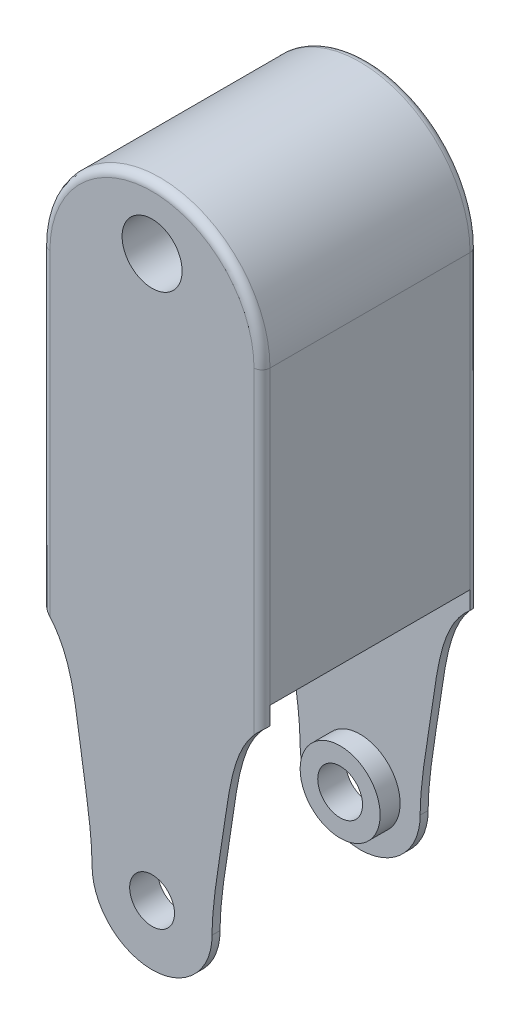
ISO-10303-21;
HEADER;
FILE_DESCRIPTION(('STEP AP214'),'2;1');
FILE_NAME('part.step','',(''),(''),'','','');
FILE_SCHEMA(('AUTOMOTIVE_DESIGN { 1 0 10303 214 1 1 1 1 }'));
ENDSEC;
DATA;
#1=APPLICATION_CONTEXT('core data for automotive mechanical design processes');
#2=APPLICATION_PROTOCOL_DEFINITION('international standard','automotive_design',2000,#1);
#3=PRODUCT_CONTEXT('',#1,'mechanical');
#4=PRODUCT('Part','Part','',(#3));
#5=PRODUCT_RELATED_PRODUCT_CATEGORY('part','',(#4));
#6=PRODUCT_DEFINITION_FORMATION('','',#4);
#7=PRODUCT_DEFINITION_CONTEXT('part definition',#1,'design');
#8=PRODUCT_DEFINITION('design','',#6,#7);
#9=PRODUCT_DEFINITION_SHAPE('','',#8);
#10=(LENGTH_UNIT() NAMED_UNIT(*) SI_UNIT(.MILLI.,.METRE.));
#11=(NAMED_UNIT(*) PLANE_ANGLE_UNIT() SI_UNIT($,.RADIAN.));
#12=(NAMED_UNIT(*) SI_UNIT($,.STERADIAN.) SOLID_ANGLE_UNIT());
#13=UNCERTAINTY_MEASURE_WITH_UNIT(LENGTH_MEASURE(1.E-05),#10,'distance_accuracy_value','');
#14=(GEOMETRIC_REPRESENTATION_CONTEXT(3) GLOBAL_UNCERTAINTY_ASSIGNED_CONTEXT((#13)) GLOBAL_UNIT_ASSIGNED_CONTEXT((#10,
#11,#12)) REPRESENTATION_CONTEXT('',''));
#15=CARTESIAN_POINT('',(0.,0.,0.));
#16=DIRECTION('',(0.,0.,1.));
#17=DIRECTION('',(1.,0.,0.));
#18=AXIS2_PLACEMENT_3D('',#15,#16,#17);
#19=CARTESIAN_POINT('',(36.9707204209095,142.990900166277,2.));
#20=DIRECTION('',(0.,0.,1.));
#21=DIRECTION('',(1.,0.,0.));
#22=AXIS2_PLACEMENT_3D('',#19,#20,#21);
#23=TOROIDAL_SURFACE('',#22,25.5,2.);
#24=CARTESIAN_POINT('',(62.4707204209095,142.990900166277,2.));
#25=DIRECTION('',(0.,-1.,0.));
#26=DIRECTION('',(0.,0.,-1.));
#27=AXIS2_PLACEMENT_3D('',#24,#25,#26);
#28=CIRCLE('',#27,2.);
#29=CARTESIAN_POINT('',(62.4707204209095,142.990900166277,0.));
#30=VERTEX_POINT('',#29);
#31=CARTESIAN_POINT('',(64.4707204209095,142.990900166277,2.));
#32=VERTEX_POINT('',#31);
#33=EDGE_CURVE('E12',#30,#32,#28,.T.);
#34=ORIENTED_EDGE('',*,*,#33,.F.);
#35=CARTESIAN_POINT('',(36.9707204209095,142.990900166277,0.));
#36=DIRECTION('',(0.,0.,1.));
#37=DIRECTION('',(1.,0.,0.));
#38=AXIS2_PLACEMENT_3D('',#35,#36,#37);
#39=CIRCLE('',#38,25.5);
#40=CARTESIAN_POINT('',(11.4707204209095,142.990900166277,0.));
#41=VERTEX_POINT('',#40);
#42=EDGE_CURVE('E408',#41,#30,#39,.F.);
#43=ORIENTED_EDGE('',*,*,#42,.F.);
#44=CARTESIAN_POINT('',(11.4707204209095,142.990900166277,2.));
#45=DIRECTION('',(0.,1.,0.));
#46=DIRECTION('',(0.,0.,1.));
#47=AXIS2_PLACEMENT_3D('',#44,#45,#46);
#48=CIRCLE('',#47,2.);
#49=CARTESIAN_POINT('',(9.47072042090954,142.990900166277,2.));
#50=VERTEX_POINT('',#49);
#51=EDGE_CURVE('E79',#41,#50,#48,.T.);
#52=ORIENTED_EDGE('',*,*,#51,.T.);
#53=CARTESIAN_POINT('',(36.9707204209095,142.990900166277,2.));
#54=DIRECTION('',(0.,0.,1.));
#55=DIRECTION('',(1.,0.,0.));
#56=AXIS2_PLACEMENT_3D('',#53,#54,#55);
#57=CIRCLE('',#56,27.5);
#58=EDGE_CURVE('E176',#32,#50,#57,.T.);
#59=ORIENTED_EDGE('',*,*,#58,.F.);
#60=EDGE_LOOP('',(#34,#43,#52,#59));
#61=FACE_BOUND('',#60,.T.);
#62=ADVANCED_FACE('F72',(#61),#23,.T.);
#63=CARTESIAN_POINT('',(11.4707204209095,0.,2.));
#64=DIRECTION('',(0.,1.,0.));
#65=DIRECTION('',(0.,0.,1.));
#66=AXIS2_PLACEMENT_3D('',#63,#64,#65);
#67=CYLINDRICAL_SURFACE('',#66,2.);
#68=ORIENTED_EDGE('',*,*,#51,.F.);
#69=DIRECTION('',(0.,1.,0.));
#70=VECTOR('',#69,1.);
#71=CARTESIAN_POINT('',(11.4707204209095,0.,0.));
#72=LINE('',#71,#70);
#73=CARTESIAN_POINT('',(11.4707204209095,63.6147126063138,0.));
#74=VERTEX_POINT('',#73);
#75=EDGE_CURVE('E405',#74,#41,#72,.T.);
#76=ORIENTED_EDGE('',*,*,#75,.F.);
#77=CARTESIAN_POINT('',(9.47072042090954,65.5541899717277,2.));
#78=CARTESIAN_POINT('',(9.47071047717841,65.5541962728773,1.95338896970983));
#79=CARTESIAN_POINT('',(9.47234956363022,65.5528357390161,1.90678388317699));
#80=CARTESIAN_POINT('',(9.47884995221513,65.5474296498482,1.81397756091869));
#81=CARTESIAN_POINT('',(9.48370970149895,65.5433853885052,1.76777614143583));
#82=CARTESIAN_POINT('',(9.49653739812568,65.5326923397141,1.67639637641352));
#83=CARTESIAN_POINT('',(9.50448666446431,65.5260592050907,1.63121357696197));
#84=CARTESIAN_POINT('',(9.52334899972217,65.5102819271053,1.54192820417429));
#85=CARTESIAN_POINT('',(9.53426228072028,65.5011376040642,1.49782570838148));
#86=CARTESIAN_POINT('',(9.57115895572199,65.4701295995274,1.36773595695999));
#87=CARTESIAN_POINT('',(9.60133263256857,65.44466331306,1.28373634298544));
#88=CARTESIAN_POINT('',(9.67112621389369,65.3852374495434,1.12297423054821));
#89=CARTESIAN_POINT('',(9.71075869742204,65.3512665594458,1.04622156095782));
#90=CARTESIAN_POINT('',(9.80040463071576,65.2736095630106,0.896297932378445));
#91=CARTESIAN_POINT('',(9.8509265128967,65.2294343624845,0.823686969129786));
#92=CARTESIAN_POINT('',(9.95833947017902,65.1343039487511,0.688446343844762));
#93=CARTESIAN_POINT('',(10.0152300755657,65.0833492355032,0.625815946532818));
#94=CARTESIAN_POINT('',(10.1656558013531,64.9467125405763,0.479129522209721));
#95=CARTESIAN_POINT('',(10.262336585965,64.8571797041258,0.401865395835025));
#96=CARTESIAN_POINT('',(10.4615744610854,64.6682143234012,0.269086343973096));
#97=CARTESIAN_POINT('',(10.5641591601723,64.5687333361212,0.21368505970429));
#98=CARTESIAN_POINT('',(10.735042629976,64.3988726836297,0.13876669548864));
#99=CARTESIAN_POINT('',(10.8028342712169,64.3304297569665,0.113472334319357));
#100=CARTESIAN_POINT('',(10.9385616366423,64.1911655832728,0.0707849911724412));
#101=CARTESIAN_POINT('',(11.0064974264853,64.1203427924269,0.053397248780108));
#102=CARTESIAN_POINT('',(11.1410565479503,63.9777560578748,0.0261762132517761));
#103=CARTESIAN_POINT('',(11.2076857307507,63.9060145095727,0.01625235390419));
#104=CARTESIAN_POINT('',(11.3399876216287,63.7612523831201,0.00317642649454057));
#105=CARTESIAN_POINT('',(11.4056616917116,63.688234039576,1.35288680119028E-05));
#106=CARTESIAN_POINT('',(11.4707204209095,63.6147126063138,0.));
#107=B_SPLINE_CURVE_WITH_KNOTS('',3,(#77,#78,#79,#80,#81,#82,#83,#84,#85,#86,#87,#88,#89,#90,
#91,#92,#93,#94,#95,#96,#97,#98,#99,#100,#101,#102,#103,#104,#105,#106),.UNSPECIFIED.,.F.,.F.,
(4,2,2,2,2,2,2,2,2,2,2,2,2,2,4),(0.,0.139774631087031,0.279481918526984,0.418357277827689,
0.557242576449319,0.834319971064426,1.11176791818241,1.40730934065786,1.70282898030532,
2.15855864592595,2.61662690151746,2.91509982317581,3.21377025067191,3.50875541888894,
3.80326773098129),.UNSPECIFIED.);
#108=CARTESIAN_POINT('',(9.47072042090954,65.5541899717277,2.));
#109=VERTEX_POINT('',#108);
#110=EDGE_CURVE('E272',#109,#74,#107,.T.);
#111=ORIENTED_EDGE('',*,*,#110,.F.);
#112=DIRECTION('',(0.,-1.,0.));
#113=VECTOR('',#112,1.);
#114=CARTESIAN_POINT('',(9.47072042090954,0.,2.));
#115=LINE('',#114,#113);
#116=CARTESIAN_POINT('',(9.47072042090955,70.,2.));
#117=VERTEX_POINT('',#116);
#118=EDGE_CURVE('E211',#117,#109,#115,.T.);
#119=ORIENTED_EDGE('',*,*,#118,.F.);
#120=DIRECTION('',(0.,1.,0.));
#121=VECTOR('',#120,1.);
#122=CARTESIAN_POINT('',(9.47072042090954,142.990900166277,2.));
#123=LINE('',#122,#121);
#124=EDGE_CURVE('E280',#50,#117,#123,.F.);
#125=ORIENTED_EDGE('',*,*,#124,.F.);
#126=EDGE_LOOP('',(#68,#76,#111,#119,#125));
#127=FACE_BOUND('',#126,.T.);
#128=ADVANCED_FACE('F282',(#127),#67,.T.);
#129=CARTESIAN_POINT('',(62.4707204209095,0.,2.));
#130=DIRECTION('',(0.,-1.,0.));
#131=DIRECTION('',(0.,0.,-1.));
#132=AXIS2_PLACEMENT_3D('',#129,#130,#131);
#133=CYLINDRICAL_SURFACE('',#132,2.);
#134=DIRECTION('',(0.,-1.,0.));
#135=VECTOR('',#134,1.);
#136=CARTESIAN_POINT('',(62.4707204209095,0.,0.));
#137=LINE('',#136,#135);
#138=CARTESIAN_POINT('',(62.4707204209095,63.54822419723,0.));
#139=VERTEX_POINT('',#138);
#140=EDGE_CURVE('E409',#30,#139,#137,.T.);
#141=ORIENTED_EDGE('',*,*,#140,.F.);
#142=ORIENTED_EDGE('',*,*,#33,.T.);
#143=DIRECTION('',(0.,-1.,0.));
#144=VECTOR('',#143,1.);
#145=CARTESIAN_POINT('',(64.4707204209095,142.990900166277,2.));
#146=LINE('',#145,#144);
#147=CARTESIAN_POINT('',(64.4707204209095,70.,2.));
#148=VERTEX_POINT('',#147);
#149=EDGE_CURVE('E168',#148,#32,#146,.F.);
#150=ORIENTED_EDGE('',*,*,#149,.F.);
#151=DIRECTION('',(0.,1.,0.));
#152=VECTOR('',#151,1.);
#153=CARTESIAN_POINT('',(64.4707204209095,0.,2.));
#154=LINE('',#153,#152);
#155=CARTESIAN_POINT('',(64.4707204209095,65.5053070407885,2.));
#156=VERTEX_POINT('',#155);
#157=EDGE_CURVE('E172',#156,#148,#154,.T.);
#158=ORIENTED_EDGE('',*,*,#157,.F.);
#159=CARTESIAN_POINT('',(62.4707204209095,63.54822419723,0.));
#160=CARTESIAN_POINT('',(62.5441057424861,63.6319652745113,2.20051502430552E-05));
#161=CARTESIAN_POINT('',(62.6182982463745,63.715072557465,0.00404263495905445));
#162=CARTESIAN_POINT('',(62.7679253463713,63.879669879174,0.0207632202095305));
#163=CARTESIAN_POINT('',(62.8433627455207,63.9611549694089,0.03348648035841));
#164=CARTESIAN_POINT('',(62.9955855335355,64.1226341907436,0.068503640627136));
#165=CARTESIAN_POINT('',(63.0723764022221,64.202600011731,0.0909069861975637));
#166=CARTESIAN_POINT('',(63.2254614059481,64.3591893370318,0.146090585630653));
#167=CARTESIAN_POINT('',(63.301756033511,64.4358168081339,0.178858119193551));
#168=CARTESIAN_POINT('',(63.4703643694932,64.602256842793,0.264598493103674));
#169=CARTESIAN_POINT('',(63.5622849691218,64.6910004267453,0.320496071517096));
#170=CARTESIAN_POINT('',(63.7404176776921,64.8596110712055,0.450813321240541));
#171=CARTESIAN_POINT('',(63.8266510338658,64.9395120274531,0.525158452066944));
#172=CARTESIAN_POINT('',(63.9739481034515,65.0736549845569,0.677394217181054));
#173=CARTESIAN_POINT('',(64.0366757414499,65.129884479653,0.751905375666595));
#174=CARTESIAN_POINT('',(64.1529458354946,65.2328685443936,0.913716347476554));
#175=CARTESIAN_POINT('',(64.2064927117992,65.2796276757082,1.00100996868375));
#176=CARTESIAN_POINT('',(64.2933772217627,65.3548056422789,1.17200697671687));
#177=CARTESIAN_POINT('',(64.3285847814029,65.384969926145,1.25398959471054));
#178=CARTESIAN_POINT('',(64.3882490027613,65.4358105821797,1.42449301192564));
#179=CARTESIAN_POINT('',(64.4127235974864,65.4565027831865,1.51300261428233));
#180=CARTESIAN_POINT('',(64.4440986708557,65.4829575480818,1.66816071101614));
#181=CARTESIAN_POINT('',(64.4540290312737,65.491302304072,1.73377589893191));
#182=CARTESIAN_POINT('',(64.4673633343918,65.5024927882459,1.86624159522534));
#183=CARTESIAN_POINT('',(64.4707557817086,65.5053288307206,1.93309407116868));
#184=CARTESIAN_POINT('',(64.4707204209095,65.5053070405309,2.00000000004391));
#185=B_SPLINE_CURVE_WITH_KNOTS('',3,(#159,#160,#161,#162,#163,#164,#165,#166,#167,#168,#169,
#170,#171,#172,#173,#174,#175,#176,#177,#178,#179,#180,#181,#182,#183,#184),.UNSPECIFIED.,.F.,
.F.,(4,2,2,2,2,2,2,2,2,2,2,2,4),(0.,0.334044934144329,0.668987925001582,1.00782124041015,
1.34624029806866,1.76322586095667,2.17855320385325,2.51468182995748,2.85064816306123,
3.13203237769417,3.41294463778561,3.61307040868564,3.81354773382866),.UNSPECIFIED.);
#186=EDGE_CURVE('E175',#139,#156,#185,.T.);
#187=ORIENTED_EDGE('',*,*,#186,.F.);
#188=EDGE_LOOP('',(#141,#142,#150,#158,#187));
#189=FACE_BOUND('',#188,.T.);
#190=ADVANCED_FACE('F170',(#189),#133,.T.);
#191=CARTESIAN_POINT('',(36.9707204209095,142.990900166277,52.));
#192=DIRECTION('',(0.,0.,1.));
#193=DIRECTION('',(1.,0.,0.));
#194=AXIS2_PLACEMENT_3D('',#191,#192,#193);
#195=TOROIDAL_SURFACE('',#194,25.5,2.);
#196=CARTESIAN_POINT('',(11.4707204209095,142.990900166277,52.));
#197=DIRECTION('',(0.,-1.,0.));
#198=DIRECTION('',(0.,0.,-1.));
#199=AXIS2_PLACEMENT_3D('',#196,#197,#198);
#200=CIRCLE('',#199,2.);
#201=CARTESIAN_POINT('',(11.4707204209095,142.990900166277,54.));
#202=VERTEX_POINT('',#201);
#203=CARTESIAN_POINT('',(9.47072042090954,142.990900166277,52.));
#204=VERTEX_POINT('',#203);
#205=EDGE_CURVE('E414',#202,#204,#200,.T.);
#206=ORIENTED_EDGE('',*,*,#205,.F.);
#207=CARTESIAN_POINT('',(36.9707204209095,142.990900166277,54.));
#208=DIRECTION('',(0.,0.,1.));
#209=DIRECTION('',(1.,0.,0.));
#210=AXIS2_PLACEMENT_3D('',#207,#208,#209);
#211=CIRCLE('',#210,25.5);
#212=CARTESIAN_POINT('',(62.4707204209095,142.990900166277,54.));
#213=VERTEX_POINT('',#212);
#214=EDGE_CURVE('E495',#213,#202,#211,.T.);
#215=ORIENTED_EDGE('',*,*,#214,.F.);
#216=CARTESIAN_POINT('',(62.4707204209095,142.990900166277,52.));
#217=DIRECTION('',(0.,1.,0.));
#218=DIRECTION('',(0.,0.,1.));
#219=AXIS2_PLACEMENT_3D('',#216,#217,#218);
#220=CIRCLE('',#219,2.);
#221=CARTESIAN_POINT('',(64.4707204209095,142.990900166277,52.));
#222=VERTEX_POINT('',#221);
#223=EDGE_CURVE('E416',#213,#222,#220,.T.);
#224=ORIENTED_EDGE('',*,*,#223,.T.);
#225=CARTESIAN_POINT('',(36.9707204209095,142.990900166277,52.));
#226=DIRECTION('',(0.,0.,1.));
#227=DIRECTION('',(1.,0.,0.));
#228=AXIS2_PLACEMENT_3D('',#225,#226,#227);
#229=CIRCLE('',#228,27.5);
#230=EDGE_CURVE('E426',#204,#222,#229,.F.);
#231=ORIENTED_EDGE('',*,*,#230,.F.);
#232=EDGE_LOOP('',(#206,#215,#224,#231));
#233=FACE_BOUND('',#232,.T.);
#234=ADVANCED_FACE('F287',(#233),#195,.T.);
#235=CARTESIAN_POINT('',(62.4707204209095,0.,52.));
#236=DIRECTION('',(0.,-1.,0.));
#237=DIRECTION('',(0.,0.,-1.));
#238=AXIS2_PLACEMENT_3D('',#235,#236,#237);
#239=CYLINDRICAL_SURFACE('',#238,2.);
#240=ORIENTED_EDGE('',*,*,#223,.F.);
#241=DIRECTION('',(0.,1.,0.));
#242=VECTOR('',#241,1.);
#243=CARTESIAN_POINT('',(62.4707204209095,0.,54.));
#244=LINE('',#243,#242);
#245=CARTESIAN_POINT('',(62.4707204209095,63.54822419723,54.));
#246=VERTEX_POINT('',#245);
#247=EDGE_CURVE('E482',#246,#213,#244,.T.);
#248=ORIENTED_EDGE('',*,*,#247,.F.);
#249=CARTESIAN_POINT('',(64.4707204209095,65.5053070407885,52.));
#250=CARTESIAN_POINT('',(64.4707303988852,65.5053134326946,52.0465062267122));
#251=CARTESIAN_POINT('',(64.4690985997476,65.5039474120796,52.0930064605758));
#252=CARTESIAN_POINT('',(64.4626275572252,65.4985199186537,52.1856027899285));
#253=CARTESIAN_POINT('',(64.4577898803378,65.4944597622848,52.2316990716612));
#254=CARTESIAN_POINT('',(64.4450215788353,65.4837256676826,52.3228664211467));
#255=CARTESIAN_POINT('',(64.4371097365506,65.4770676009666,52.3679419882689));
#256=CARTESIAN_POINT('',(64.4183377808386,65.4612324251754,52.4570136130179));
#257=CARTESIAN_POINT('',(64.4074774526058,65.452055132567,52.5010095917388));
#258=CARTESIAN_POINT('',(64.3707640344463,65.420939088865,52.6307796298619));
#259=CARTESIAN_POINT('',(64.3407447976305,65.395388148577,52.7145681497441));
#260=CARTESIAN_POINT('',(64.2713239119989,65.3357793056089,52.8749258376739));
#261=CARTESIAN_POINT('',(64.2319095891647,65.3017099084228,52.9514850568791));
#262=CARTESIAN_POINT('',(64.1427556438496,65.2238287273929,53.1010744152663));
#263=CARTESIAN_POINT('',(64.0925078139832,65.1795239630006,53.1735423146327));
#264=CARTESIAN_POINT('',(63.9856970259488,65.0841351833331,53.3085357699718));
#265=CARTESIAN_POINT('',(63.9291345974232,65.033051736558,53.3710621587324));
#266=CARTESIAN_POINT('',(63.7792097781466,64.8957391523267,53.5179313883503));
#267=CARTESIAN_POINT('',(63.6826856253408,64.8056062074703,53.5954180812204));
#268=CARTESIAN_POINT('',(63.4837904644989,64.6153858643246,53.7286184514229));
#269=CARTESIAN_POINT('',(63.3813916683527,64.5152491503573,53.7842168395878));
#270=CARTESIAN_POINT('',(63.2103097424011,64.3437526256795,53.8597027003456));
#271=CARTESIAN_POINT('',(63.1421193878688,64.2743143928675,53.885297244533));
#272=CARTESIAN_POINT('',(63.0056079389765,64.1330174367349,53.9284768596655));
#273=CARTESIAN_POINT('',(62.9372867871967,64.0611570966476,53.9460564621611));
#274=CARTESIAN_POINT('',(62.8019996990418,63.9164962732735,53.9735663455655));
#275=CARTESIAN_POINT('',(62.7350275201776,63.8437189428401,53.9835899508322));
#276=CARTESIAN_POINT('',(62.6020681887186,63.6968706091834,53.9967941136659));
#277=CARTESIAN_POINT('',(62.5360795970668,63.6228019308231,53.9999859001853));
#278=CARTESIAN_POINT('',(62.4707204209095,63.54822419723,54.));
#279=B_SPLINE_CURVE_WITH_KNOTS('',3,(#249,#250,#251,#252,#253,#254,#255,#256,#257,#258,#259,
#260,#261,#262,#263,#264,#265,#266,#267,#268,#269,#270,#271,#272,#273,#274,#275,#276,#277,#278),
.UNSPECIFIED.,.F.,.F.,(4,2,2,2,2,2,2,2,2,2,2,2,2,2,4),(0.,0.139460130116107,0.278852165615816,
0.417405615510833,0.555969162124937,0.832396205338673,1.10919828171202,1.4041844650486,
1.69914592472802,2.15596477285992,2.61515855795383,2.91672160003086,3.21849008632844,
3.51646743413719,3.8139546414552),.UNSPECIFIED.);
#280=CARTESIAN_POINT('',(64.4707204209095,65.5053070407885,52.));
#281=VERTEX_POINT('',#280);
#282=EDGE_CURVE('E429',#281,#246,#279,.T.);
#283=ORIENTED_EDGE('',*,*,#282,.F.);
#284=DIRECTION('',(0.,-1.,0.));
#285=VECTOR('',#284,1.);
#286=CARTESIAN_POINT('',(64.4707204209095,70.,52.));
#287=LINE('',#286,#285);
#288=CARTESIAN_POINT('',(64.4707204209095,70.,52.));
#289=VERTEX_POINT('',#288);
#290=EDGE_CURVE('E200',#289,#281,#287,.T.);
#291=ORIENTED_EDGE('',*,*,#290,.F.);
#292=DIRECTION('',(0.,1.,0.));
#293=VECTOR('',#292,1.);
#294=CARTESIAN_POINT('',(64.4707204209095,0.,52.));
#295=LINE('',#294,#293);
#296=EDGE_CURVE('E182',#222,#289,#295,.F.);
#297=ORIENTED_EDGE('',*,*,#296,.F.);
#298=EDGE_LOOP('',(#240,#248,#283,#291,#297));
#299=FACE_BOUND('',#298,.T.);
#300=ADVANCED_FACE('F438',(#299),#239,.T.);
#301=CARTESIAN_POINT('',(11.4707204209095,0.,52.));
#302=DIRECTION('',(0.,1.,0.));
#303=DIRECTION('',(0.,0.,1.));
#304=AXIS2_PLACEMENT_3D('',#301,#302,#303);
#305=CYLINDRICAL_SURFACE('',#304,2.);
#306=DIRECTION('',(0.,-1.,0.));
#307=VECTOR('',#306,1.);
#308=CARTESIAN_POINT('',(11.4707204209095,0.,54.));
#309=LINE('',#308,#307);
#310=CARTESIAN_POINT('',(11.4707204209095,63.6147126063138,54.));
#311=VERTEX_POINT('',#310);
#312=EDGE_CURVE('E374',#202,#311,#309,.T.);
#313=ORIENTED_EDGE('',*,*,#312,.F.);
#314=ORIENTED_EDGE('',*,*,#205,.T.);
#315=DIRECTION('',(0.,-1.,0.));
#316=VECTOR('',#315,1.);
#317=CARTESIAN_POINT('',(9.47072042090954,0.,52.));
#318=LINE('',#317,#316);
#319=CARTESIAN_POINT('',(9.47072042090955,70.,52.));
#320=VERTEX_POINT('',#319);
#321=EDGE_CURVE('E422',#320,#204,#318,.F.);
#322=ORIENTED_EDGE('',*,*,#321,.F.);
#323=DIRECTION('',(0.,1.,0.));
#324=VECTOR('',#323,1.);
#325=CARTESIAN_POINT('',(9.47072042090954,70.,52.));
#326=LINE('',#325,#324);
#327=CARTESIAN_POINT('',(9.47072042090954,65.5541899717277,52.));
#328=VERTEX_POINT('',#327);
#329=EDGE_CURVE('E199',#328,#320,#326,.T.);
#330=ORIENTED_EDGE('',*,*,#329,.F.);
#331=CARTESIAN_POINT('',(11.4707204209095,63.6147126063138,54.));
#332=CARTESIAN_POINT('',(11.3976453688247,63.6972981294634,53.999978881365));
#333=CARTESIAN_POINT('',(11.3237806120137,63.7792566128206,53.9959915730982));
#334=CARTESIAN_POINT('',(11.1748453381045,63.9415718733119,53.9794222600896));
#335=CARTESIAN_POINT('',(11.0997721654772,64.0219238827553,53.9668177282142));
#336=CARTESIAN_POINT('',(10.9483209964411,64.1811456743484,53.9321475853824));
#337=CARTESIAN_POINT('',(10.8719379026328,64.2599879462198,53.9099752853356));
#338=CARTESIAN_POINT('',(10.7196811100264,64.4143874535374,53.85539070402));
#339=CARTESIAN_POINT('',(10.6438069124737,64.4899484935347,53.8229906630104));
#340=CARTESIAN_POINT('',(10.4751898463058,64.6550158114735,53.7377849556318));
#341=CARTESIAN_POINT('',(10.3828612676624,64.743411343639,53.6819263432348));
#342=CARTESIAN_POINT('',(10.203971219409,64.911327370077,53.5516196739219));
#343=CARTESIAN_POINT('',(10.1173883521877,64.9908816358474,53.477246136333));
#344=CARTESIAN_POINT('',(9.96951514592859,65.1244230397715,53.3249165329429));
#345=CARTESIAN_POINT('',(9.90654910430813,65.1803934186846,53.250343673367));
#346=CARTESIAN_POINT('',(9.78985550485987,65.2828865057833,53.0884038281129));
#347=CARTESIAN_POINT('',(9.73612358187842,65.3294136798551,53.0010429239686));
#348=CARTESIAN_POINT('',(9.64885636112767,65.404289343073,52.8297669892486));
#349=CARTESIAN_POINT('',(9.61346315117936,65.4343575116274,52.7475535344984));
#350=CARTESIAN_POINT('',(9.55350029384863,65.485022262643,52.5765765461332));
#351=CARTESIAN_POINT('',(9.52891274403235,65.5056345138369,52.4878241331327));
#352=CARTESIAN_POINT('',(9.49741959655068,65.5319646843878,52.3323211150152));
#353=CARTESIAN_POINT('',(9.48745969900727,65.5402636141025,52.2666061601864));
#354=CARTESIAN_POINT('',(9.47408695546579,65.5513916270586,52.1339464452592));
#355=CARTESIAN_POINT('',(9.47068534366946,65.5542113245586,52.0669997728819));
#356=CARTESIAN_POINT('',(9.47072042090954,65.5541899778969,52.0000000010445));
#357=B_SPLINE_CURVE_WITH_KNOTS('',3,(#331,#332,#333,#334,#335,#336,#337,#338,#339,#340,#341,
#342,#343,#344,#345,#346,#347,#348,#349,#350,#351,#352,#353,#354,#355,#356),.UNSPECIFIED.,.F.,
.F.,(4,2,2,2,2,2,2,2,2,2,2,2,4),(0.,0.330826168727681,0.662520506508853,0.998013186374074,
1.33310587102797,1.75017674388598,2.16559537675458,2.50185463330718,2.83795449347336,
3.12005297358858,3.40168230465122,3.60209910785155,3.80285891674193),.UNSPECIFIED.);
#358=EDGE_CURVE('E263',#311,#328,#357,.T.);
#359=ORIENTED_EDGE('',*,*,#358,.F.);
#360=EDGE_LOOP('',(#313,#314,#322,#330,#359));
#361=FACE_BOUND('',#360,.T.);
#362=ADVANCED_FACE('F442',(#361),#305,.T.);
#363=CARTESIAN_POINT('',(0.,0.,2.));
#364=DIRECTION('',(0.,0.,-1.));
#365=DIRECTION('',(-1.,0.,0.));
#366=AXIS2_PLACEMENT_3D('',#363,#364,#365);
#367=PLANE('',#366);
#368=DIRECTION('',(-1.,0.,0.));
#369=VECTOR('',#368,1.);
#370=CARTESIAN_POINT('',(0.,70.,2.));
#371=LINE('',#370,#369);
#372=EDGE_CURVE('E196',#148,#117,#371,.T.);
#373=ORIENTED_EDGE('',*,*,#372,.T.);
#374=ORIENTED_EDGE('',*,*,#118,.T.);
#375=CARTESIAN_POINT('',(22.,15.,2.));
#376=CARTESIAN_POINT('',(22.,22.3179609326105,2.));
#377=CARTESIAN_POINT('',(17.7777196426996,44.524463783592,2.));
#378=CARTESIAN_POINT('',(15.9035134383819,66.3006355740785,2.));
#379=CARTESIAN_POINT('',(0.,70.,2.));
#380=B_SPLINE_CURVE_WITH_KNOTS('',3,(#375,#376,#377,#378,#379),.UNSPECIFIED.,.F.,.F.,(4,1,4),
(0.,0.399675275534026,1.),.UNSPECIFIED.);
#381=CARTESIAN_POINT('',(22.,15.,2.));
#382=VERTEX_POINT('',#381);
#383=EDGE_CURVE('E371',#382,#109,#380,.T.);
#384=ORIENTED_EDGE('',*,*,#383,.F.);
#385=CARTESIAN_POINT('',(37.,15.,2.));
#386=DIRECTION('',(0.,0.,-1.));
#387=DIRECTION('',(-1.,0.,0.));
#388=AXIS2_PLACEMENT_3D('',#385,#386,#387);
#389=CIRCLE('',#388,15.);
#390=CARTESIAN_POINT('',(52.,15.,2.));
#391=VERTEX_POINT('',#390);
#392=EDGE_CURVE('E350',#391,#382,#389,.T.);
#393=ORIENTED_EDGE('',*,*,#392,.F.);
#394=CARTESIAN_POINT('',(74.,70.,2.));
#395=CARTESIAN_POINT('',(58.0964865616181,66.3006355740785,2.));
#396=CARTESIAN_POINT('',(56.2222803573004,44.524463783592,2.));
#397=CARTESIAN_POINT('',(52.,22.3179609326106,2.));
#398=CARTESIAN_POINT('',(52.,15.,2.));
#399=B_SPLINE_CURVE_WITH_KNOTS('',3,(#394,#395,#396,#397,#398),.UNSPECIFIED.,.F.,.F.,(4,1,4),
(0.,0.600324724465974,1.),.UNSPECIFIED.);
#400=EDGE_CURVE('E198',#156,#391,#399,.T.);
#401=ORIENTED_EDGE('',*,*,#400,.F.);
#402=ORIENTED_EDGE('',*,*,#157,.T.);
#403=EDGE_LOOP('',(#373,#374,#384,#393,#401,#402));
#404=FACE_BOUND('',#403,.T.);
#405=CARTESIAN_POINT('',(37.,15.,2.));
#406=DIRECTION('',(0.,0.,-1.));
#407=DIRECTION('',(-1.,0.,0.));
#408=AXIS2_PLACEMENT_3D('',#405,#406,#407);
#409=CIRCLE('',#408,10.);
#410=CARTESIAN_POINT('',(27.,15.,2.));
#411=VERTEX_POINT('',#410);
#412=EDGE_CURVE('E189',#411,#411,#409,.F.);
#413=ORIENTED_EDGE('',*,*,#412,.F.);
#414=EDGE_LOOP('',(#413));
#415=FACE_BOUND('',#414,.T.);
#416=ADVANCED_FACE('F193',(#404,#415),#367,.F.);
#417=CARTESIAN_POINT('',(0.,70.,52.));
#418=DIRECTION('',(0.,0.,1.));
#419=DIRECTION('',(0.,-1.,0.));
#420=AXIS2_PLACEMENT_3D('',#417,#418,#419);
#421=PLANE('',#420);
#422=CARTESIAN_POINT('',(22.,15.,52.));
#423=CARTESIAN_POINT('',(22.,22.3179609326105,52.));
#424=CARTESIAN_POINT('',(17.7777196426996,44.524463783592,52.));
#425=CARTESIAN_POINT('',(15.9035134383819,66.3006355740785,52.));
#426=CARTESIAN_POINT('',(0.,70.,52.));
#427=B_SPLINE_CURVE_WITH_KNOTS('',3,(#422,#423,#424,#425,#426),.UNSPECIFIED.,.F.,.F.,(4,1,4),
(0.,0.399675275534026,1.),.UNSPECIFIED.);
#428=CARTESIAN_POINT('',(22.,15.,52.));
#429=VERTEX_POINT('',#428);
#430=EDGE_CURVE('E368',#328,#429,#427,.F.);
#431=ORIENTED_EDGE('',*,*,#430,.F.);
#432=ORIENTED_EDGE('',*,*,#329,.T.);
#433=DIRECTION('',(1.,0.,0.));
#434=VECTOR('',#433,1.);
#435=CARTESIAN_POINT('',(0.,70.,52.));
#436=LINE('',#435,#434);
#437=EDGE_CURVE('E206',#320,#289,#436,.T.);
#438=ORIENTED_EDGE('',*,*,#437,.T.);
#439=ORIENTED_EDGE('',*,*,#290,.T.);
#440=CARTESIAN_POINT('',(74.,70.,52.));
#441=CARTESIAN_POINT('',(58.0964865616181,66.3006355740785,52.));
#442=CARTESIAN_POINT('',(56.2222803573004,44.524463783592,52.));
#443=CARTESIAN_POINT('',(52.,22.3179609326106,52.));
#444=CARTESIAN_POINT('',(52.,15.,52.));
#445=B_SPLINE_CURVE_WITH_KNOTS('',3,(#440,#441,#442,#443,#444),.UNSPECIFIED.,.F.,.F.,(4,1,4),
(0.,0.600324724465974,1.),.UNSPECIFIED.);
#446=CARTESIAN_POINT('',(52.,15.,52.));
#447=VERTEX_POINT('',#446);
#448=EDGE_CURVE('E343',#447,#281,#445,.F.);
#449=ORIENTED_EDGE('',*,*,#448,.F.);
#450=CARTESIAN_POINT('',(37.,15.,52.));
#451=DIRECTION('',(0.,0.,1.));
#452=DIRECTION('',(1.,0.,0.));
#453=AXIS2_PLACEMENT_3D('',#450,#451,#452);
#454=CIRCLE('',#453,15.);
#455=EDGE_CURVE('E331',#429,#447,#454,.T.);
#456=ORIENTED_EDGE('',*,*,#455,.F.);
#457=EDGE_LOOP('',(#431,#432,#438,#439,#449,#456));
#458=FACE_BOUND('',#457,.T.);
#459=CARTESIAN_POINT('',(37.,15.,52.));
#460=DIRECTION('',(0.,0.,1.));
#461=DIRECTION('',(0.,-1.,0.));
#462=AXIS2_PLACEMENT_3D('',#459,#460,#461);
#463=CIRCLE('',#462,10.);
#464=CARTESIAN_POINT('',(37.,5.,52.));
#465=VERTEX_POINT('',#464);
#466=EDGE_CURVE('E354',#465,#465,#463,.F.);
#467=ORIENTED_EDGE('',*,*,#466,.F.);
#468=EDGE_LOOP('',(#467));
#469=FACE_BOUND('',#468,.T.);
#470=ADVANCED_FACE('F302',(#458,#469),#421,.F.);
#471=CARTESIAN_POINT('',(0.,0.,54.));
#472=DIRECTION('',(0.,0.,1.));
#473=DIRECTION('',(1.,0.,0.));
#474=AXIS2_PLACEMENT_3D('',#471,#472,#473);
#475=PLANE('',#474);
#476=CARTESIAN_POINT('',(74.,70.,54.));
#477=CARTESIAN_POINT('',(58.0964865616181,66.3006355740785,54.));
#478=CARTESIAN_POINT('',(56.2222803573004,44.524463783592,54.));
#479=CARTESIAN_POINT('',(52.,22.3179609326106,54.));
#480=CARTESIAN_POINT('',(52.,15.,54.));
#481=B_SPLINE_CURVE_WITH_KNOTS('',3,(#476,#477,#478,#479,#480),.UNSPECIFIED.,.F.,.F.,(4,1,4),
(0.,0.600324724465974,1.),.UNSPECIFIED.);
#482=CARTESIAN_POINT('',(52.,15.,54.));
#483=VERTEX_POINT('',#482);
#484=EDGE_CURVE('E337',#483,#246,#481,.F.);
#485=ORIENTED_EDGE('',*,*,#484,.T.);
#486=ORIENTED_EDGE('',*,*,#247,.T.);
#487=ORIENTED_EDGE('',*,*,#214,.T.);
#488=ORIENTED_EDGE('',*,*,#312,.T.);
#489=CARTESIAN_POINT('',(22.,15.,54.));
#490=CARTESIAN_POINT('',(22.,22.3179609326105,54.));
#491=CARTESIAN_POINT('',(17.7777196426996,44.524463783592,54.));
#492=CARTESIAN_POINT('',(15.9035134383819,66.3006355740785,54.));
#493=CARTESIAN_POINT('',(0.,70.,54.));
#494=B_SPLINE_CURVE_WITH_KNOTS('',3,(#489,#490,#491,#492,#493),.UNSPECIFIED.,.F.,.F.,(4,1,4),
(0.,0.399675275534026,1.),.UNSPECIFIED.);
#495=CARTESIAN_POINT('',(22.,15.,54.));
#496=VERTEX_POINT('',#495);
#497=EDGE_CURVE('E311',#311,#496,#494,.F.);
#498=ORIENTED_EDGE('',*,*,#497,.T.);
#499=CARTESIAN_POINT('',(37.,15.,54.));
#500=DIRECTION('',(0.,0.,1.));
#501=DIRECTION('',(1.,0.,0.));
#502=AXIS2_PLACEMENT_3D('',#499,#500,#501);
#503=CIRCLE('',#502,15.);
#504=EDGE_CURVE('E334',#496,#483,#503,.T.);
#505=ORIENTED_EDGE('',*,*,#504,.T.);
#506=EDGE_LOOP('',(#485,#486,#487,#488,#498,#505));
#507=FACE_BOUND('',#506,.T.);
#508=CARTESIAN_POINT('',(37.,15.,54.));
#509=DIRECTION('',(0.,0.,1.));
#510=DIRECTION('',(1.,0.,0.));
#511=AXIS2_PLACEMENT_3D('',#508,#509,#510);
#512=CIRCLE('',#511,5.6);
#513=CARTESIAN_POINT('',(42.6,15.,54.));
#514=VERTEX_POINT('',#513);
#515=EDGE_CURVE('E235',#514,#514,#512,.T.);
#516=ORIENTED_EDGE('',*,*,#515,.F.);
#517=EDGE_LOOP('',(#516));
#518=FACE_BOUND('',#517,.T.);
#519=CARTESIAN_POINT('',(37.,155.,54.));
#520=DIRECTION('',(0.,0.,1.));
#521=DIRECTION('',(1.,0.,0.));
#522=AXIS2_PLACEMENT_3D('',#519,#520,#521);
#523=CIRCLE('',#522,7.5);
#524=CARTESIAN_POINT('',(44.5,155.,54.));
#525=VERTEX_POINT('',#524);
#526=EDGE_CURVE('E344',#525,#525,#523,.T.);
#527=ORIENTED_EDGE('',*,*,#526,.F.);
#528=EDGE_LOOP('',(#527));
#529=FACE_BOUND('',#528,.T.);
#530=ADVANCED_FACE('F479',(#507,#518,#529),#475,.T.);
#531=CARTESIAN_POINT('',(0.,0.,0.));
#532=DIRECTION('',(0.,0.,1.));
#533=DIRECTION('',(1.,0.,0.));
#534=AXIS2_PLACEMENT_3D('',#531,#532,#533);
#535=PLANE('',#534);
#536=CARTESIAN_POINT('',(37.,15.,0.));
#537=DIRECTION('',(0.,0.,-1.));
#538=DIRECTION('',(-1.,0.,0.));
#539=AXIS2_PLACEMENT_3D('',#536,#537,#538);
#540=CIRCLE('',#539,5.6);
#541=CARTESIAN_POINT('',(31.4,15.,0.));
#542=VERTEX_POINT('',#541);
#543=EDGE_CURVE('E232',#542,#542,#540,.T.);
#544=ORIENTED_EDGE('',*,*,#543,.F.);
#545=EDGE_LOOP('',(#544));
#546=FACE_BOUND('',#545,.T.);
#547=CARTESIAN_POINT('',(22.,15.,0.));
#548=CARTESIAN_POINT('',(22.,22.3179609326105,0.));
#549=CARTESIAN_POINT('',(17.7777196426996,44.524463783592,0.));
#550=CARTESIAN_POINT('',(15.9035134383819,66.3006355740785,0.));
#551=CARTESIAN_POINT('',(0.,70.,0.));
#552=B_SPLINE_CURVE_WITH_KNOTS('',3,(#547,#548,#549,#550,#551),.UNSPECIFIED.,.F.,.F.,(4,1,4),
(0.,0.399675275534026,1.),.UNSPECIFIED.);
#553=CARTESIAN_POINT('',(22.,15.,0.));
#554=VERTEX_POINT('',#553);
#555=EDGE_CURVE('E238',#554,#74,#552,.T.);
#556=ORIENTED_EDGE('',*,*,#555,.T.);
#557=ORIENTED_EDGE('',*,*,#75,.T.);
#558=ORIENTED_EDGE('',*,*,#42,.T.);
#559=ORIENTED_EDGE('',*,*,#140,.T.);
#560=CARTESIAN_POINT('',(74.,70.,0.));
#561=CARTESIAN_POINT('',(58.0964865616181,66.3006355740785,0.));
#562=CARTESIAN_POINT('',(56.2222803573004,44.524463783592,0.));
#563=CARTESIAN_POINT('',(52.,22.3179609326106,0.));
#564=CARTESIAN_POINT('',(52.,15.,0.));
#565=B_SPLINE_CURVE_WITH_KNOTS('',3,(#560,#561,#562,#563,#564),.UNSPECIFIED.,.F.,.F.,(4,1,4),
(0.,0.600324724465974,1.),.UNSPECIFIED.);
#566=CARTESIAN_POINT('',(52.,15.,0.));
#567=VERTEX_POINT('',#566);
#568=EDGE_CURVE('E314',#139,#567,#565,.T.);
#569=ORIENTED_EDGE('',*,*,#568,.T.);
#570=CARTESIAN_POINT('',(37.,15.,0.));
#571=DIRECTION('',(0.,0.,-1.));
#572=DIRECTION('',(-1.,0.,0.));
#573=AXIS2_PLACEMENT_3D('',#570,#571,#572);
#574=CIRCLE('',#573,15.);
#575=EDGE_CURVE('E321',#567,#554,#574,.T.);
#576=ORIENTED_EDGE('',*,*,#575,.T.);
#577=EDGE_LOOP('',(#556,#557,#558,#559,#569,#576));
#578=FACE_BOUND('',#577,.T.);
#579=CARTESIAN_POINT('',(37.,155.,0.));
#580=DIRECTION('',(0.,0.,1.));
#581=DIRECTION('',(1.,0.,0.));
#582=AXIS2_PLACEMENT_3D('',#579,#580,#581);
#583=CIRCLE('',#582,7.5);
#584=CARTESIAN_POINT('',(44.5,155.,0.));
#585=VERTEX_POINT('',#584);
#586=EDGE_CURVE('E342',#585,#585,#583,.T.);
#587=ORIENTED_EDGE('',*,*,#586,.T.);
#588=EDGE_LOOP('',(#587));
#589=FACE_BOUND('',#588,.T.);
#590=ADVANCED_FACE('F401',(#546,#578,#589),#535,.F.);
#591=CARTESIAN_POINT('',(37.,155.,54.));
#592=DIRECTION('',(0.,0.,-1.));
#593=DIRECTION('',(-1.,0.,0.));
#594=AXIS2_PLACEMENT_3D('',#591,#592,#593);
#595=CYLINDRICAL_SURFACE('',#594,7.5);
#596=ORIENTED_EDGE('',*,*,#526,.T.);
#597=EDGE_LOOP('',(#596));
#598=FACE_BOUND('',#597,.T.);
#599=ORIENTED_EDGE('',*,*,#586,.F.);
#600=EDGE_LOOP('',(#599));
#601=FACE_BOUND('',#600,.T.);
#602=ADVANCED_FACE('F444',(#598,#601),#595,.F.);
#603=CARTESIAN_POINT('',(37.,15.,74.));
#604=DIRECTION('',(0.,0.,-1.));
#605=DIRECTION('',(-1.,0.,0.));
#606=AXIS2_PLACEMENT_3D('',#603,#604,#605);
#607=CYLINDRICAL_SURFACE('',#606,15.);
#608=ORIENTED_EDGE('',*,*,#392,.T.);
#609=DIRECTION('',(0.,0.,-1.));
#610=VECTOR('',#609,1.);
#611=CARTESIAN_POINT('',(22.,15.,74.));
#612=LINE('',#611,#610);
#613=EDGE_CURVE('E391',#382,#554,#612,.T.);
#614=ORIENTED_EDGE('',*,*,#613,.T.);
#615=ORIENTED_EDGE('',*,*,#575,.F.);
#616=DIRECTION('',(0.,0.,-1.));
#617=VECTOR('',#616,1.);
#618=CARTESIAN_POINT('',(52.,15.,74.));
#619=LINE('',#618,#617);
#620=EDGE_CURVE('E327',#391,#567,#619,.T.);
#621=ORIENTED_EDGE('',*,*,#620,.F.);
#622=EDGE_LOOP('',(#608,#614,#615,#621));
#623=FACE_BOUND('',#622,.T.);
#624=ADVANCED_FACE('F460',(#623),#607,.T.);
#625=CARTESIAN_POINT('',(74.,70.,74.));
#626=CARTESIAN_POINT('',(58.0964865616181,66.3006355740785,74.));
#627=CARTESIAN_POINT('',(56.2222803573004,44.524463783592,74.));
#628=CARTESIAN_POINT('',(52.,22.3179609326106,74.));
#629=CARTESIAN_POINT('',(52.,15.,74.));
#630=B_SPLINE_CURVE_WITH_KNOTS('',3,(#625,#626,#627,#628,#629),.UNSPECIFIED.,.F.,.F.,(4,1,4),
(0.,0.600324724465974,1.),.UNSPECIFIED.);
#631=DIRECTION('',(0.,0.,-1.));
#632=VECTOR('',#631,1.);
#633=SURFACE_OF_LINEAR_EXTRUSION('',#630,#632);
#634=ORIENTED_EDGE('',*,*,#568,.F.);
#635=ORIENTED_EDGE('',*,*,#186,.T.);
#636=ORIENTED_EDGE('',*,*,#400,.T.);
#637=ORIENTED_EDGE('',*,*,#620,.T.);
#638=EDGE_LOOP('',(#634,#635,#636,#637));
#639=FACE_BOUND('',#638,.T.);
#640=ADVANCED_FACE('F300',(#639),#633,.T.);
#641=ORIENTED_EDGE('',*,*,#448,.T.);
#642=ORIENTED_EDGE('',*,*,#282,.T.);
#643=ORIENTED_EDGE('',*,*,#484,.F.);
#644=EDGE_CURVE('E330',#483,#447,#619,.T.);
#645=ORIENTED_EDGE('',*,*,#644,.T.);
#646=EDGE_LOOP('',(#641,#642,#643,#645));
#647=FACE_BOUND('',#646,.T.);
#648=ADVANCED_FACE('F295',(#647),#633,.T.);
#649=ORIENTED_EDGE('',*,*,#455,.T.);
#650=ORIENTED_EDGE('',*,*,#644,.F.);
#651=ORIENTED_EDGE('',*,*,#504,.F.);
#652=EDGE_CURVE('E386',#496,#429,#612,.T.);
#653=ORIENTED_EDGE('',*,*,#652,.T.);
#654=EDGE_LOOP('',(#649,#650,#651,#653));
#655=FACE_BOUND('',#654,.T.);
#656=ADVANCED_FACE('F256',(#655),#607,.T.);
#657=CARTESIAN_POINT('',(22.,15.,74.));
#658=CARTESIAN_POINT('',(22.,22.3179609326105,74.));
#659=CARTESIAN_POINT('',(17.7777196426996,44.524463783592,74.));
#660=CARTESIAN_POINT('',(15.9035134383819,66.3006355740785,74.));
#661=CARTESIAN_POINT('',(0.,70.,74.));
#662=B_SPLINE_CURVE_WITH_KNOTS('',3,(#657,#658,#659,#660,#661),.UNSPECIFIED.,.F.,.F.,(4,1,4),
(0.,0.399675275534026,1.),.UNSPECIFIED.);
#663=DIRECTION('',(0.,0.,-1.));
#664=VECTOR('',#663,1.);
#665=SURFACE_OF_LINEAR_EXTRUSION('',#662,#664);
#666=ORIENTED_EDGE('',*,*,#497,.F.);
#667=ORIENTED_EDGE('',*,*,#358,.T.);
#668=ORIENTED_EDGE('',*,*,#430,.T.);
#669=ORIENTED_EDGE('',*,*,#652,.F.);
#670=EDGE_LOOP('',(#666,#667,#668,#669));
#671=FACE_BOUND('',#670,.T.);
#672=ADVANCED_FACE('F250',(#671),#665,.T.);
#673=ORIENTED_EDGE('',*,*,#383,.T.);
#674=ORIENTED_EDGE('',*,*,#110,.T.);
#675=ORIENTED_EDGE('',*,*,#555,.F.);
#676=ORIENTED_EDGE('',*,*,#613,.F.);
#677=EDGE_LOOP('',(#673,#674,#675,#676));
#678=FACE_BOUND('',#677,.T.);
#679=ADVANCED_FACE('F255',(#678),#665,.T.);
#680=CARTESIAN_POINT('',(37.,15.,74.));
#681=DIRECTION('',(0.,0.,-1.));
#682=DIRECTION('',(-1.,0.,0.));
#683=AXIS2_PLACEMENT_3D('',#680,#681,#682);
#684=CYLINDRICAL_SURFACE('',#683,5.6);
#685=ORIENTED_EDGE('',*,*,#543,.T.);
#686=EDGE_LOOP('',(#685));
#687=FACE_BOUND('',#686,.T.);
#688=CARTESIAN_POINT('',(37.,15.,7.));
#689=DIRECTION('',(0.,0.,1.));
#690=DIRECTION('',(1.,0.,0.));
#691=AXIS2_PLACEMENT_3D('',#688,#689,#690);
#692=CIRCLE('',#691,5.6);
#693=CARTESIAN_POINT('',(42.6,15.,7.));
#694=VERTEX_POINT('',#693);
#695=EDGE_CURVE('E205',#694,#694,#692,.T.);
#696=ORIENTED_EDGE('',*,*,#695,.T.);
#697=EDGE_LOOP('',(#696));
#698=FACE_BOUND('',#697,.T.);
#699=ADVANCED_FACE('F540',(#687,#698),#684,.F.);
#700=ORIENTED_EDGE('',*,*,#515,.T.);
#701=EDGE_LOOP('',(#700));
#702=FACE_BOUND('',#701,.T.);
#703=CARTESIAN_POINT('',(37.,15.,47.));
#704=DIRECTION('',(0.,0.,-1.));
#705=DIRECTION('',(0.,1.,0.));
#706=AXIS2_PLACEMENT_3D('',#703,#704,#705);
#707=CIRCLE('',#706,5.6);
#708=CARTESIAN_POINT('',(37.,20.6,47.));
#709=VERTEX_POINT('',#708);
#710=EDGE_CURVE('E226',#709,#709,#707,.T.);
#711=ORIENTED_EDGE('',*,*,#710,.T.);
#712=EDGE_LOOP('',(#711));
#713=FACE_BOUND('',#712,.T.);
#714=ADVANCED_FACE('F258',(#702,#713),#684,.F.);
#715=CARTESIAN_POINT('',(37.,15.,47.));
#716=DIRECTION('',(0.,0.,-1.));
#717=DIRECTION('',(0.,1.,0.));
#718=AXIS2_PLACEMENT_3D('',#715,#716,#717);
#719=PLANE('',#718);
#720=CARTESIAN_POINT('',(37.,15.,47.));
#721=DIRECTION('',(0.,0.,-1.));
#722=DIRECTION('',(0.,1.,0.));
#723=AXIS2_PLACEMENT_3D('',#720,#721,#722);
#724=CIRCLE('',#723,10.);
#725=CARTESIAN_POINT('',(37.,25.,47.));
#726=VERTEX_POINT('',#725);
#727=EDGE_CURVE('E229',#726,#726,#724,.T.);
#728=ORIENTED_EDGE('',*,*,#727,.T.);
#729=EDGE_LOOP('',(#728));
#730=FACE_BOUND('',#729,.T.);
#731=ORIENTED_EDGE('',*,*,#710,.F.);
#732=EDGE_LOOP('',(#731));
#733=FACE_BOUND('',#732,.T.);
#734=ADVANCED_FACE('F517',(#730,#733),#719,.T.);
#735=CARTESIAN_POINT('',(37.,15.,47.));
#736=DIRECTION('',(0.,0.,1.));
#737=DIRECTION('',(0.,-1.,0.));
#738=AXIS2_PLACEMENT_3D('',#735,#736,#737);
#739=CYLINDRICAL_SURFACE('',#738,10.);
#740=ORIENTED_EDGE('',*,*,#727,.F.);
#741=EDGE_LOOP('',(#740));
#742=FACE_BOUND('',#741,.T.);
#743=ORIENTED_EDGE('',*,*,#466,.T.);
#744=EDGE_LOOP('',(#743));
#745=FACE_BOUND('',#744,.T.);
#746=ADVANCED_FACE('F512',(#742,#745),#739,.T.);
#747=CARTESIAN_POINT('',(37.,15.,7.));
#748=DIRECTION('',(0.,0.,1.));
#749=DIRECTION('',(1.,0.,0.));
#750=AXIS2_PLACEMENT_3D('',#747,#748,#749);
#751=PLANE('',#750);
#752=CARTESIAN_POINT('',(37.,15.,7.));
#753=DIRECTION('',(0.,0.,1.));
#754=DIRECTION('',(1.,0.,0.));
#755=AXIS2_PLACEMENT_3D('',#752,#753,#754);
#756=CIRCLE('',#755,10.);
#757=CARTESIAN_POINT('',(47.,15.,7.));
#758=VERTEX_POINT('',#757);
#759=EDGE_CURVE('E209',#758,#758,#756,.T.);
#760=ORIENTED_EDGE('',*,*,#759,.T.);
#761=EDGE_LOOP('',(#760));
#762=FACE_BOUND('',#761,.T.);
#763=ORIENTED_EDGE('',*,*,#695,.F.);
#764=EDGE_LOOP('',(#763));
#765=FACE_BOUND('',#764,.T.);
#766=ADVANCED_FACE('F509',(#762,#765),#751,.T.);
#767=CARTESIAN_POINT('',(37.,15.,7.));
#768=DIRECTION('',(0.,0.,-1.));
#769=DIRECTION('',(-1.,0.,0.));
#770=AXIS2_PLACEMENT_3D('',#767,#768,#769);
#771=CYLINDRICAL_SURFACE('',#770,10.);
#772=ORIENTED_EDGE('',*,*,#759,.F.);
#773=EDGE_LOOP('',(#772));
#774=FACE_BOUND('',#773,.T.);
#775=ORIENTED_EDGE('',*,*,#412,.T.);
#776=EDGE_LOOP('',(#775));
#777=FACE_BOUND('',#776,.T.);
#778=ADVANCED_FACE('F508',(#774,#777),#771,.T.);
#779=CARTESIAN_POINT('',(74.,70.,54.));
#780=DIRECTION('',(0.,-1.,0.));
#781=DIRECTION('',(0.,0.,-1.));
#782=AXIS2_PLACEMENT_3D('',#779,#780,#781);
#783=PLANE('',#782);
#784=DIRECTION('',(0.,0.,1.));
#785=VECTOR('',#784,1.);
#786=CARTESIAN_POINT('',(9.47072042090955,70.,54.));
#787=LINE('',#786,#785);
#788=EDGE_CURVE('E188',#117,#320,#787,.T.);
#789=ORIENTED_EDGE('',*,*,#788,.F.);
#790=ORIENTED_EDGE('',*,*,#372,.F.);
#791=DIRECTION('',(0.,0.,-1.));
#792=VECTOR('',#791,1.);
#793=CARTESIAN_POINT('',(64.4707204209095,70.,54.));
#794=LINE('',#793,#792);
#795=EDGE_CURVE('E179',#289,#148,#794,.T.);
#796=ORIENTED_EDGE('',*,*,#795,.F.);
#797=ORIENTED_EDGE('',*,*,#437,.F.);
#798=EDGE_LOOP('',(#789,#790,#796,#797));
#799=FACE_BOUND('',#798,.T.);
#800=ADVANCED_FACE('F203',(#799),#783,.T.);
#801=CARTESIAN_POINT('',(36.9707204209095,142.990900166277,0.));
#802=DIRECTION('',(0.,0.,1.));
#803=DIRECTION('',(1.,0.,0.));
#804=AXIS2_PLACEMENT_3D('',#801,#802,#803);
#805=CYLINDRICAL_SURFACE('',#804,27.5);
#806=DIRECTION('',(0.,0.,1.));
#807=VECTOR('',#806,1.);
#808=CARTESIAN_POINT('',(64.4707204209095,142.990900166277,0.));
#809=LINE('',#808,#807);
#810=EDGE_CURVE('E491',#32,#222,#809,.T.);
#811=ORIENTED_EDGE('',*,*,#810,.F.);
#812=ORIENTED_EDGE('',*,*,#58,.T.);
#813=DIRECTION('',(0.,0.,1.));
#814=VECTOR('',#813,1.);
#815=CARTESIAN_POINT('',(9.47072042090954,142.990900166277,0.));
#816=LINE('',#815,#814);
#817=EDGE_CURVE('E490',#50,#204,#816,.T.);
#818=ORIENTED_EDGE('',*,*,#817,.T.);
#819=ORIENTED_EDGE('',*,*,#230,.T.);
#820=EDGE_LOOP('',(#811,#812,#818,#819));
#821=FACE_BOUND('',#820,.T.);
#822=ADVANCED_FACE('F494',(#821),#805,.T.);
#823=CARTESIAN_POINT('',(9.47072042090954,142.990900166277,0.));
#824=DIRECTION('',(1.,0.,0.));
#825=DIRECTION('',(0.,0.,-1.));
#826=AXIS2_PLACEMENT_3D('',#823,#824,#825);
#827=PLANE('',#826);
#828=ORIENTED_EDGE('',*,*,#817,.F.);
#829=ORIENTED_EDGE('',*,*,#124,.T.);
#830=ORIENTED_EDGE('',*,*,#788,.T.);
#831=ORIENTED_EDGE('',*,*,#321,.T.);
#832=EDGE_LOOP('',(#828,#829,#830,#831));
#833=FACE_BOUND('',#832,.T.);
#834=ADVANCED_FACE('F496',(#833),#827,.F.);
#835=CARTESIAN_POINT('',(64.4707204209095,142.990900166277,0.));
#836=DIRECTION('',(-1.,0.,0.));
#837=DIRECTION('',(0.,0.,1.));
#838=AXIS2_PLACEMENT_3D('',#835,#836,#837);
#839=PLANE('',#838);
#840=ORIENTED_EDGE('',*,*,#795,.T.);
#841=ORIENTED_EDGE('',*,*,#149,.T.);
#842=ORIENTED_EDGE('',*,*,#810,.T.);
#843=ORIENTED_EDGE('',*,*,#296,.T.);
#844=EDGE_LOOP('',(#840,#841,#842,#843));
#845=FACE_BOUND('',#844,.T.);
#846=ADVANCED_FACE('F180',(#845),#839,.F.);
#847=CLOSED_SHELL('',(#62,#128,#190,#234,#300,#362,#416,#470,#530,#590,#602,#624,#640,#648,#656,
#672,#679,#699,#714,#734,#746,#766,#778,#800,#822,#834,#846));
#848=MANIFOLD_SOLID_BREP('B2',#847);
#849=ADVANCED_BREP_SHAPE_REPRESENTATION('',(#18,#848),#14);
#850=SHAPE_DEFINITION_REPRESENTATION(#9,#849);
ENDSEC;
END-ISO-10303-21;
